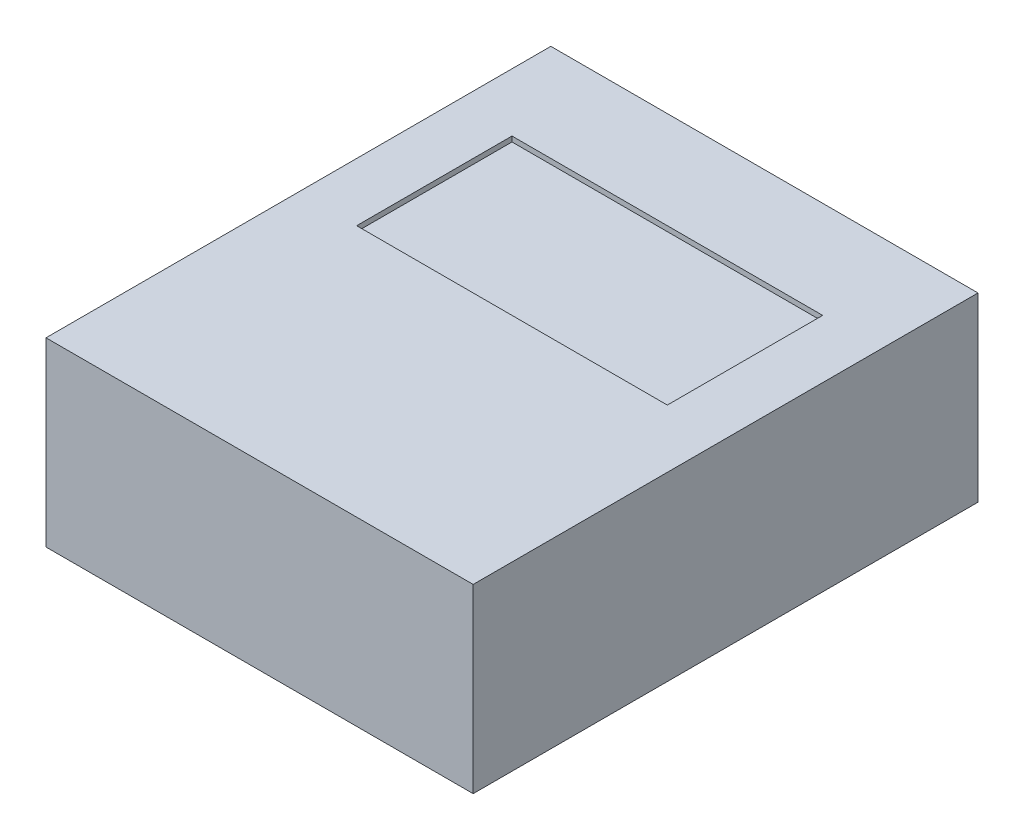
ISO-10303-21;
HEADER;
FILE_DESCRIPTION(('STEP AP214'),'2;1');
FILE_NAME('part.step','',(''),(''),'','','');
FILE_SCHEMA(('AUTOMOTIVE_DESIGN { 1 0 10303 214 1 1 1 1 }'));
ENDSEC;
DATA;
#1=APPLICATION_CONTEXT('core data for automotive mechanical design processes');
#2=APPLICATION_PROTOCOL_DEFINITION('international standard','automotive_design',2000,#1);
#3=PRODUCT_CONTEXT('',#1,'mechanical');
#4=PRODUCT('Part','Part','',(#3));
#5=PRODUCT_RELATED_PRODUCT_CATEGORY('part','',(#4));
#6=PRODUCT_DEFINITION_FORMATION('','',#4);
#7=PRODUCT_DEFINITION_CONTEXT('part definition',#1,'design');
#8=PRODUCT_DEFINITION('design','',#6,#7);
#9=PRODUCT_DEFINITION_SHAPE('','',#8);
#10=(LENGTH_UNIT() NAMED_UNIT(*) SI_UNIT(.MILLI.,.METRE.));
#11=(NAMED_UNIT(*) PLANE_ANGLE_UNIT() SI_UNIT($,.RADIAN.));
#12=(NAMED_UNIT(*) SI_UNIT($,.STERADIAN.) SOLID_ANGLE_UNIT());
#13=UNCERTAINTY_MEASURE_WITH_UNIT(LENGTH_MEASURE(1.E-05),#10,'distance_accuracy_value','');
#14=(GEOMETRIC_REPRESENTATION_CONTEXT(3) GLOBAL_UNCERTAINTY_ASSIGNED_CONTEXT((#13)) GLOBAL_UNIT_ASSIGNED_CONTEXT((#10,
#11,#12)) REPRESENTATION_CONTEXT('',''));
#15=CARTESIAN_POINT('',(0.,0.,0.));
#16=DIRECTION('',(0.,0.,1.));
#17=DIRECTION('',(1.,0.,0.));
#18=AXIS2_PLACEMENT_3D('',#15,#16,#17);
#19=CARTESIAN_POINT('',(82.5,35.,97.5));
#20=DIRECTION('',(-1.,0.,0.));
#21=DIRECTION('',(0.,0.,1.));
#22=AXIS2_PLACEMENT_3D('',#19,#20,#21);
#23=PLANE('',#22);
#24=DIRECTION('',(0.,0.,-1.));
#25=VECTOR('',#24,1.);
#26=CARTESIAN_POINT('',(82.5,-35.,97.5));
#27=LINE('',#26,#25);
#28=CARTESIAN_POINT('',(82.5,-35.,97.5));
#29=VERTEX_POINT('',#28);
#30=CARTESIAN_POINT('',(82.5,-35.,-97.5));
#31=VERTEX_POINT('',#30);
#32=EDGE_CURVE('E162',#29,#31,#27,.T.);
#33=ORIENTED_EDGE('',*,*,#32,.T.);
#34=DIRECTION('',(0.,-1.,0.));
#35=VECTOR('',#34,1.);
#36=CARTESIAN_POINT('',(82.5,35.,-97.5));
#37=LINE('',#36,#35);
#38=CARTESIAN_POINT('',(82.5,35.,-97.5));
#39=VERTEX_POINT('',#38);
#40=EDGE_CURVE('E11',#39,#31,#37,.T.);
#41=ORIENTED_EDGE('',*,*,#40,.F.);
#42=DIRECTION('',(0.,0.,-1.));
#43=VECTOR('',#42,1.);
#44=CARTESIAN_POINT('',(82.5,35.,97.5));
#45=LINE('',#44,#43);
#46=CARTESIAN_POINT('',(82.5,35.,97.5));
#47=VERTEX_POINT('',#46);
#48=EDGE_CURVE('E168',#47,#39,#45,.T.);
#49=ORIENTED_EDGE('',*,*,#48,.F.);
#50=DIRECTION('',(0.,-1.,0.));
#51=VECTOR('',#50,1.);
#52=CARTESIAN_POINT('',(82.5,35.,97.5));
#53=LINE('',#52,#51);
#54=EDGE_CURVE('E178',#47,#29,#53,.T.);
#55=ORIENTED_EDGE('',*,*,#54,.T.);
#56=EDGE_LOOP('',(#33,#41,#49,#55));
#57=FACE_BOUND('',#56,.T.);
#58=ADVANCED_FACE('F43',(#57),#23,.F.);
#59=CARTESIAN_POINT('',(-82.5,35.,-97.5));
#60=DIRECTION('',(0.,0.,1.));
#61=DIRECTION('',(1.,0.,0.));
#62=AXIS2_PLACEMENT_3D('',#59,#60,#61);
#63=PLANE('',#62);
#64=DIRECTION('',(-1.,0.,0.));
#65=VECTOR('',#64,1.);
#66=CARTESIAN_POINT('',(-82.5,-35.,-97.5));
#67=LINE('',#66,#65);
#68=CARTESIAN_POINT('',(-82.5,-35.,-97.5));
#69=VERTEX_POINT('',#68);
#70=EDGE_CURVE('E182',#31,#69,#67,.T.);
#71=ORIENTED_EDGE('',*,*,#70,.T.);
#72=DIRECTION('',(0.,-1.,0.));
#73=VECTOR('',#72,1.);
#74=CARTESIAN_POINT('',(-82.5,35.,-97.5));
#75=LINE('',#74,#73);
#76=CARTESIAN_POINT('',(-82.5,35.,-97.5));
#77=VERTEX_POINT('',#76);
#78=EDGE_CURVE('E51',#77,#69,#75,.T.);
#79=ORIENTED_EDGE('',*,*,#78,.F.);
#80=DIRECTION('',(-1.,0.,0.));
#81=VECTOR('',#80,1.);
#82=CARTESIAN_POINT('',(-82.5,35.,-97.5));
#83=LINE('',#82,#81);
#84=EDGE_CURVE('E95',#39,#77,#83,.T.);
#85=ORIENTED_EDGE('',*,*,#84,.F.);
#86=ORIENTED_EDGE('',*,*,#40,.T.);
#87=EDGE_LOOP('',(#71,#79,#85,#86));
#88=FACE_BOUND('',#87,.T.);
#89=ADVANCED_FACE('F217',(#88),#63,.F.);
#90=CARTESIAN_POINT('',(-82.5,35.,97.5));
#91=DIRECTION('',(1.,0.,0.));
#92=DIRECTION('',(0.,0.,-1.));
#93=AXIS2_PLACEMENT_3D('',#90,#91,#92);
#94=PLANE('',#93);
#95=DIRECTION('',(0.,0.,1.));
#96=VECTOR('',#95,1.);
#97=CARTESIAN_POINT('',(-82.5,-35.,97.5));
#98=LINE('',#97,#96);
#99=CARTESIAN_POINT('',(-82.5,-35.,97.5));
#100=VERTEX_POINT('',#99);
#101=EDGE_CURVE('E185',#69,#100,#98,.T.);
#102=ORIENTED_EDGE('',*,*,#101,.T.);
#103=DIRECTION('',(0.,-1.,0.));
#104=VECTOR('',#103,1.);
#105=CARTESIAN_POINT('',(-82.5,35.,97.5));
#106=LINE('',#105,#104);
#107=CARTESIAN_POINT('',(-82.5,35.,97.5));
#108=VERTEX_POINT('',#107);
#109=EDGE_CURVE('E192',#108,#100,#106,.T.);
#110=ORIENTED_EDGE('',*,*,#109,.F.);
#111=DIRECTION('',(0.,0.,1.));
#112=VECTOR('',#111,1.);
#113=CARTESIAN_POINT('',(-82.5,35.,97.5));
#114=LINE('',#113,#112);
#115=EDGE_CURVE('E173',#77,#108,#114,.T.);
#116=ORIENTED_EDGE('',*,*,#115,.F.);
#117=ORIENTED_EDGE('',*,*,#78,.T.);
#118=EDGE_LOOP('',(#102,#110,#116,#117));
#119=FACE_BOUND('',#118,.T.);
#120=ADVANCED_FACE('F199',(#119),#94,.F.);
#121=CARTESIAN_POINT('',(-82.5,35.,97.5));
#122=DIRECTION('',(0.,0.,-1.));
#123=DIRECTION('',(-1.,0.,0.));
#124=AXIS2_PLACEMENT_3D('',#121,#122,#123);
#125=PLANE('',#124);
#126=DIRECTION('',(1.,0.,0.));
#127=VECTOR('',#126,1.);
#128=CARTESIAN_POINT('',(-82.5,-35.,97.5));
#129=LINE('',#128,#127);
#130=EDGE_CURVE('E88',#100,#29,#129,.T.);
#131=ORIENTED_EDGE('',*,*,#130,.T.);
#132=ORIENTED_EDGE('',*,*,#54,.F.);
#133=DIRECTION('',(1.,0.,0.));
#134=VECTOR('',#133,1.);
#135=CARTESIAN_POINT('',(-82.5,35.,97.5));
#136=LINE('',#135,#134);
#137=EDGE_CURVE('E67',#108,#47,#136,.T.);
#138=ORIENTED_EDGE('',*,*,#137,.F.);
#139=ORIENTED_EDGE('',*,*,#109,.T.);
#140=EDGE_LOOP('',(#131,#132,#138,#139));
#141=FACE_BOUND('',#140,.T.);
#142=ADVANCED_FACE('F207',(#141),#125,.F.);
#143=CARTESIAN_POINT('',(0.,35.,0.));
#144=DIRECTION('',(0.,-1.,0.));
#145=DIRECTION('',(0.,0.,-1.));
#146=AXIS2_PLACEMENT_3D('',#143,#144,#145);
#147=PLANE('',#146);
#148=DIRECTION('',(-1.,0.,0.));
#149=VECTOR('',#148,1.);
#150=CARTESIAN_POINT('',(-60.,35.,-60.));
#151=LINE('',#150,#149);
#152=CARTESIAN_POINT('',(60.,35.,-60.));
#153=VERTEX_POINT('',#152);
#154=CARTESIAN_POINT('',(-60.,35.,-60.));
#155=VERTEX_POINT('',#154);
#156=EDGE_CURVE('E153',#153,#155,#151,.T.);
#157=ORIENTED_EDGE('',*,*,#156,.F.);
#158=DIRECTION('',(0.,0.,-1.));
#159=VECTOR('',#158,1.);
#160=CARTESIAN_POINT('',(60.,35.,0.));
#161=LINE('',#160,#159);
#162=CARTESIAN_POINT('',(60.,35.,0.));
#163=VERTEX_POINT('',#162);
#164=EDGE_CURVE('E58',#163,#153,#161,.T.);
#165=ORIENTED_EDGE('',*,*,#164,.F.);
#166=DIRECTION('',(1.,0.,0.));
#167=VECTOR('',#166,1.);
#168=CARTESIAN_POINT('',(-60.,35.,0.));
#169=LINE('',#168,#167);
#170=CARTESIAN_POINT('',(-60.,35.,0.));
#171=VERTEX_POINT('',#170);
#172=EDGE_CURVE('E140',#171,#163,#169,.T.);
#173=ORIENTED_EDGE('',*,*,#172,.F.);
#174=DIRECTION('',(0.,0.,1.));
#175=VECTOR('',#174,1.);
#176=CARTESIAN_POINT('',(-60.,35.,0.));
#177=LINE('',#176,#175);
#178=EDGE_CURVE('E144',#155,#171,#177,.T.);
#179=ORIENTED_EDGE('',*,*,#178,.F.);
#180=EDGE_LOOP('',(#157,#165,#173,#179));
#181=FACE_BOUND('',#180,.T.);
#182=ORIENTED_EDGE('',*,*,#48,.T.);
#183=ORIENTED_EDGE('',*,*,#84,.T.);
#184=ORIENTED_EDGE('',*,*,#115,.T.);
#185=ORIENTED_EDGE('',*,*,#137,.T.);
#186=EDGE_LOOP('',(#182,#183,#184,#185));
#187=FACE_BOUND('',#186,.T.);
#188=ADVANCED_FACE('F209',(#181,#187),#147,.F.);
#189=CARTESIAN_POINT('',(0.,-35.,0.));
#190=DIRECTION('',(0.,-1.,0.));
#191=DIRECTION('',(0.,0.,-1.));
#192=AXIS2_PLACEMENT_3D('',#189,#190,#191);
#193=PLANE('',#192);
#194=ORIENTED_EDGE('',*,*,#32,.F.);
#195=ORIENTED_EDGE('',*,*,#130,.F.);
#196=ORIENTED_EDGE('',*,*,#101,.F.);
#197=ORIENTED_EDGE('',*,*,#70,.F.);
#198=EDGE_LOOP('',(#194,#195,#196,#197));
#199=FACE_BOUND('',#198,.T.);
#200=ADVANCED_FACE('F203',(#199),#193,.T.);
#201=CARTESIAN_POINT('',(60.,33.,0.));
#202=DIRECTION('',(1.,0.,0.));
#203=DIRECTION('',(0.,0.,-1.));
#204=AXIS2_PLACEMENT_3D('',#201,#202,#203);
#205=PLANE('',#204);
#206=ORIENTED_EDGE('',*,*,#164,.T.);
#207=DIRECTION('',(0.,1.,0.));
#208=VECTOR('',#207,1.);
#209=CARTESIAN_POINT('',(60.,33.,-60.));
#210=LINE('',#209,#208);
#211=CARTESIAN_POINT('',(60.,33.,-60.));
#212=VERTEX_POINT('',#211);
#213=EDGE_CURVE('E115',#212,#153,#210,.T.);
#214=ORIENTED_EDGE('',*,*,#213,.F.);
#215=DIRECTION('',(0.,0.,-1.));
#216=VECTOR('',#215,1.);
#217=CARTESIAN_POINT('',(60.,33.,0.));
#218=LINE('',#217,#216);
#219=CARTESIAN_POINT('',(60.,33.,0.));
#220=VERTEX_POINT('',#219);
#221=EDGE_CURVE('E119',#220,#212,#218,.T.);
#222=ORIENTED_EDGE('',*,*,#221,.F.);
#223=DIRECTION('',(0.,1.,0.));
#224=VECTOR('',#223,1.);
#225=CARTESIAN_POINT('',(60.,33.,0.));
#226=LINE('',#225,#224);
#227=EDGE_CURVE('E159',#220,#163,#226,.T.);
#228=ORIENTED_EDGE('',*,*,#227,.T.);
#229=EDGE_LOOP('',(#206,#214,#222,#228));
#230=FACE_BOUND('',#229,.T.);
#231=ADVANCED_FACE('F117',(#230),#205,.F.);
#232=CARTESIAN_POINT('',(-60.,33.,0.));
#233=DIRECTION('',(0.,0.,1.));
#234=DIRECTION('',(1.,0.,0.));
#235=AXIS2_PLACEMENT_3D('',#232,#233,#234);
#236=PLANE('',#235);
#237=ORIENTED_EDGE('',*,*,#172,.T.);
#238=ORIENTED_EDGE('',*,*,#227,.F.);
#239=DIRECTION('',(1.,0.,0.));
#240=VECTOR('',#239,1.);
#241=CARTESIAN_POINT('',(-60.,33.,0.));
#242=LINE('',#241,#240);
#243=CARTESIAN_POINT('',(-60.,33.,0.));
#244=VERTEX_POINT('',#243);
#245=EDGE_CURVE('E126',#244,#220,#242,.T.);
#246=ORIENTED_EDGE('',*,*,#245,.F.);
#247=DIRECTION('',(0.,1.,0.));
#248=VECTOR('',#247,1.);
#249=CARTESIAN_POINT('',(-60.,33.,0.));
#250=LINE('',#249,#248);
#251=EDGE_CURVE('E163',#244,#171,#250,.T.);
#252=ORIENTED_EDGE('',*,*,#251,.T.);
#253=EDGE_LOOP('',(#237,#238,#246,#252));
#254=FACE_BOUND('',#253,.T.);
#255=ADVANCED_FACE('F260',(#254),#236,.F.);
#256=CARTESIAN_POINT('',(-60.,33.,0.));
#257=DIRECTION('',(-1.,0.,0.));
#258=DIRECTION('',(0.,0.,1.));
#259=AXIS2_PLACEMENT_3D('',#256,#257,#258);
#260=PLANE('',#259);
#261=ORIENTED_EDGE('',*,*,#178,.T.);
#262=ORIENTED_EDGE('',*,*,#251,.F.);
#263=DIRECTION('',(0.,0.,1.));
#264=VECTOR('',#263,1.);
#265=CARTESIAN_POINT('',(-60.,33.,0.));
#266=LINE('',#265,#264);
#267=CARTESIAN_POINT('',(-60.,33.,-60.));
#268=VERTEX_POINT('',#267);
#269=EDGE_CURVE('E135',#268,#244,#266,.T.);
#270=ORIENTED_EDGE('',*,*,#269,.F.);
#271=DIRECTION('',(0.,1.,0.));
#272=VECTOR('',#271,1.);
#273=CARTESIAN_POINT('',(-60.,33.,-60.));
#274=LINE('',#273,#272);
#275=EDGE_CURVE('E125',#268,#155,#274,.T.);
#276=ORIENTED_EDGE('',*,*,#275,.T.);
#277=EDGE_LOOP('',(#261,#262,#270,#276));
#278=FACE_BOUND('',#277,.T.);
#279=ADVANCED_FACE('F270',(#278),#260,.F.);
#280=CARTESIAN_POINT('',(-60.,33.,-60.));
#281=DIRECTION('',(0.,0.,-1.));
#282=DIRECTION('',(-1.,0.,0.));
#283=AXIS2_PLACEMENT_3D('',#280,#281,#282);
#284=PLANE('',#283);
#285=ORIENTED_EDGE('',*,*,#156,.T.);
#286=ORIENTED_EDGE('',*,*,#275,.F.);
#287=DIRECTION('',(-1.,0.,0.));
#288=VECTOR('',#287,1.);
#289=CARTESIAN_POINT('',(-60.,33.,-60.));
#290=LINE('',#289,#288);
#291=EDGE_CURVE('E129',#212,#268,#290,.T.);
#292=ORIENTED_EDGE('',*,*,#291,.F.);
#293=ORIENTED_EDGE('',*,*,#213,.T.);
#294=EDGE_LOOP('',(#285,#286,#292,#293));
#295=FACE_BOUND('',#294,.T.);
#296=ADVANCED_FACE('F130',(#295),#284,.F.);
#297=CARTESIAN_POINT('',(0.,33.,0.));
#298=DIRECTION('',(0.,-1.,0.));
#299=DIRECTION('',(0.,0.,-1.));
#300=AXIS2_PLACEMENT_3D('',#297,#298,#299);
#301=PLANE('',#300);
#302=ORIENTED_EDGE('',*,*,#221,.T.);
#303=ORIENTED_EDGE('',*,*,#291,.T.);
#304=ORIENTED_EDGE('',*,*,#269,.T.);
#305=ORIENTED_EDGE('',*,*,#245,.T.);
#306=EDGE_LOOP('',(#302,#303,#304,#305));
#307=FACE_BOUND('',#306,.T.);
#308=ADVANCED_FACE('F137',(#307),#301,.F.);
#309=CLOSED_SHELL('',(#58,#89,#120,#142,#188,#200,#231,#255,#279,#296,#308));
#310=MANIFOLD_SOLID_BREP('B2',#309);
#311=ADVANCED_BREP_SHAPE_REPRESENTATION('',(#18,#310),#14);
#312=SHAPE_DEFINITION_REPRESENTATION(#9,#311);
ENDSEC;
END-ISO-10303-21;
